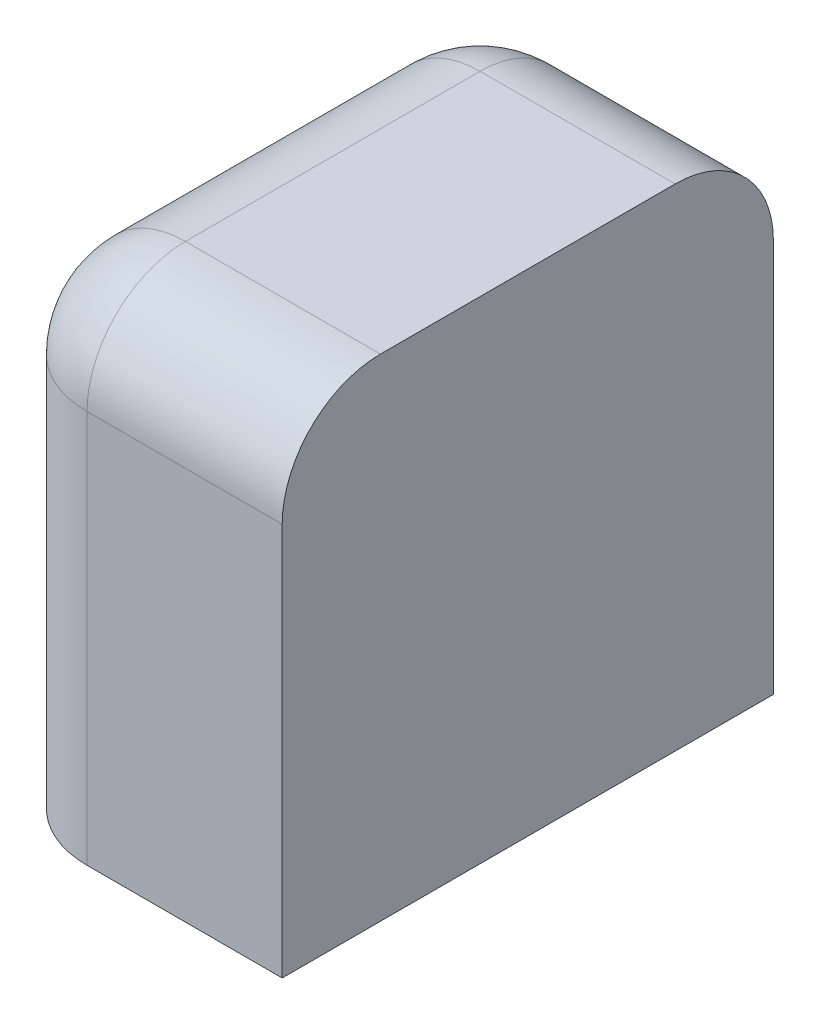
ISO-10303-21;
HEADER;
FILE_DESCRIPTION(('STEP AP214'),'2;1');
FILE_NAME('part.step','',(''),(''),'','','');
FILE_SCHEMA(('AUTOMOTIVE_DESIGN { 1 0 10303 214 1 1 1 1 }'));
ENDSEC;
DATA;
#1=APPLICATION_CONTEXT('core data for automotive mechanical design processes');
#2=APPLICATION_PROTOCOL_DEFINITION('international standard','automotive_design',2000,#1);
#3=PRODUCT_CONTEXT('',#1,'mechanical');
#4=PRODUCT('Part','Part','',(#3));
#5=PRODUCT_RELATED_PRODUCT_CATEGORY('part','',(#4));
#6=PRODUCT_DEFINITION_FORMATION('','',#4);
#7=PRODUCT_DEFINITION_CONTEXT('part definition',#1,'design');
#8=PRODUCT_DEFINITION('design','',#6,#7);
#9=PRODUCT_DEFINITION_SHAPE('','',#8);
#10=(LENGTH_UNIT() NAMED_UNIT(*) SI_UNIT(.MILLI.,.METRE.));
#11=(NAMED_UNIT(*) PLANE_ANGLE_UNIT() SI_UNIT($,.RADIAN.));
#12=(NAMED_UNIT(*) SI_UNIT($,.STERADIAN.) SOLID_ANGLE_UNIT());
#13=UNCERTAINTY_MEASURE_WITH_UNIT(LENGTH_MEASURE(1.E-05),#10,'distance_accuracy_value','');
#14=(GEOMETRIC_REPRESENTATION_CONTEXT(3) GLOBAL_UNCERTAINTY_ASSIGNED_CONTEXT((#13)) GLOBAL_UNIT_ASSIGNED_CONTEXT((#10,
#11,#12)) REPRESENTATION_CONTEXT('',''));
#15=CARTESIAN_POINT('',(0.,0.,0.));
#16=DIRECTION('',(0.,0.,1.));
#17=DIRECTION('',(1.,0.,0.));
#18=AXIS2_PLACEMENT_3D('',#15,#16,#17);
#19=CARTESIAN_POINT('',(1.8036,0.4,-0.15));
#20=DIRECTION('',(-1.,0.,0.));
#21=DIRECTION('',(0.,-0.707106781186547,0.707106781186548));
#22=AXIS2_PLACEMENT_3D('',#19,#20,#21);
#23=CYLINDRICAL_SURFACE('',#22,0.1);
#24=DIRECTION('',(-1.,0.,0.));
#25=VECTOR('',#24,1.);
#26=CARTESIAN_POINT('',(-0.2014,0.4,-0.25));
#27=LINE('',#26,#25);
#28=CARTESIAN_POINT('',(-0.2014,0.4,-0.25));
#29=VERTEX_POINT('',#28);
#30=CARTESIAN_POINT('',(-0.4,0.4,-0.25));
#31=VERTEX_POINT('',#30);
#32=EDGE_CURVE('E11',#29,#31,#27,.T.);
#33=ORIENTED_EDGE('',*,*,#32,.T.);
#34=CARTESIAN_POINT('',(-0.4,0.4,-0.15));
#35=DIRECTION('',(-1.,0.,0.));
#36=DIRECTION('',(0.,1.,0.));
#37=AXIS2_PLACEMENT_3D('',#34,#35,#36);
#38=CIRCLE('',#37,0.1);
#39=CARTESIAN_POINT('',(-0.4,0.5,-0.15));
#40=VERTEX_POINT('',#39);
#41=EDGE_CURVE('E25',#40,#31,#38,.T.);
#42=ORIENTED_EDGE('',*,*,#41,.F.);
#43=DIRECTION('',(-1.,0.,0.));
#44=VECTOR('',#43,1.);
#45=CARTESIAN_POINT('',(-0.2014,0.5,-0.15));
#46=LINE('',#45,#44);
#47=CARTESIAN_POINT('',(-0.2014,0.5,-0.15));
#48=VERTEX_POINT('',#47);
#49=EDGE_CURVE('E201',#48,#40,#46,.T.);
#50=ORIENTED_EDGE('',*,*,#49,.F.);
#51=CARTESIAN_POINT('',(-0.2014,0.4,-0.15));
#52=DIRECTION('',(1.,0.,0.));
#53=DIRECTION('',(0.,0.,-1.));
#54=AXIS2_PLACEMENT_3D('',#51,#52,#53);
#55=CIRCLE('',#54,0.1);
#56=EDGE_CURVE('E196',#29,#48,#55,.T.);
#57=ORIENTED_EDGE('',*,*,#56,.F.);
#58=EDGE_LOOP('',(#33,#42,#50,#57));
#59=FACE_BOUND('',#58,.T.);
#60=ADVANCED_FACE('F17',(#59),#23,.T.);
#61=CARTESIAN_POINT('',(-0.2014,0.,-0.25));
#62=DIRECTION('',(-1.,0.,0.));
#63=DIRECTION('',(0.,0.,1.));
#64=AXIS2_PLACEMENT_3D('',#61,#62,#63);
#65=PLANE('',#64);
#66=DIRECTION('',(0.,1.,0.));
#67=VECTOR('',#66,1.);
#68=CARTESIAN_POINT('',(-0.2014,0.,0.25));
#69=LINE('',#68,#67);
#70=CARTESIAN_POINT('',(-0.2014,0.,0.25));
#71=VERTEX_POINT('',#70);
#72=CARTESIAN_POINT('',(-0.2014,0.4,0.25));
#73=VERTEX_POINT('',#72);
#74=EDGE_CURVE('E191',#71,#73,#69,.T.);
#75=ORIENTED_EDGE('',*,*,#74,.F.);
#76=DIRECTION('',(0.,0.,-1.));
#77=VECTOR('',#76,1.);
#78=CARTESIAN_POINT('',(-0.2014,0.,0.25));
#79=LINE('',#78,#77);
#80=CARTESIAN_POINT('',(-0.2014,0.,-0.25));
#81=VERTEX_POINT('',#80);
#82=EDGE_CURVE('E187',#71,#81,#79,.T.);
#83=ORIENTED_EDGE('',*,*,#82,.T.);
#84=DIRECTION('',(0.,1.,0.));
#85=VECTOR('',#84,1.);
#86=CARTESIAN_POINT('',(-0.2014,0.,-0.25));
#87=LINE('',#86,#85);
#88=EDGE_CURVE('E182',#81,#29,#87,.T.);
#89=ORIENTED_EDGE('',*,*,#88,.T.);
#90=ORIENTED_EDGE('',*,*,#56,.T.);
#91=DIRECTION('',(0.,0.,-1.));
#92=VECTOR('',#91,1.);
#93=CARTESIAN_POINT('',(-0.2014,0.5,0.15));
#94=LINE('',#93,#92);
#95=CARTESIAN_POINT('',(-0.2014,0.5,0.15));
#96=VERTEX_POINT('',#95);
#97=EDGE_CURVE('E177',#96,#48,#94,.T.);
#98=ORIENTED_EDGE('',*,*,#97,.F.);
#99=CARTESIAN_POINT('',(-0.2014,0.4,0.15));
#100=DIRECTION('',(1.,0.,0.));
#101=DIRECTION('',(0.,1.,0.));
#102=AXIS2_PLACEMENT_3D('',#99,#100,#101);
#103=CIRCLE('',#102,0.1);
#104=EDGE_CURVE('E173',#96,#73,#103,.T.);
#105=ORIENTED_EDGE('',*,*,#104,.T.);
#106=EDGE_LOOP('',(#75,#83,#89,#90,#98,#105));
#107=FACE_BOUND('',#106,.T.);
#108=ADVANCED_FACE('F229',(#107),#65,.F.);
#109=CARTESIAN_POINT('',(-0.40189102071,0.4,0.15));
#110=DIRECTION('',(1.,0.,0.));
#111=DIRECTION('',(0.,-0.707106781186547,-0.707106781186548));
#112=AXIS2_PLACEMENT_3D('',#109,#110,#111);
#113=CYLINDRICAL_SURFACE('',#112,0.1);
#114=DIRECTION('',(1.,0.,0.));
#115=VECTOR('',#114,1.);
#116=CARTESIAN_POINT('',(-0.4,0.5,0.15));
#117=LINE('',#116,#115);
#118=CARTESIAN_POINT('',(-0.4,0.5,0.15));
#119=VERTEX_POINT('',#118);
#120=EDGE_CURVE('E168',#119,#96,#117,.T.);
#121=ORIENTED_EDGE('',*,*,#120,.F.);
#122=CARTESIAN_POINT('',(-0.4,0.4,0.15));
#123=DIRECTION('',(1.,0.,0.));
#124=DIRECTION('',(0.,1.,0.));
#125=AXIS2_PLACEMENT_3D('',#122,#123,#124);
#126=CIRCLE('',#125,0.1);
#127=CARTESIAN_POINT('',(-0.399999999999,0.4,0.25));
#128=VERTEX_POINT('',#127);
#129=EDGE_CURVE('E111',#119,#128,#126,.T.);
#130=ORIENTED_EDGE('',*,*,#129,.T.);
#131=DIRECTION('',(1.,0.,0.));
#132=VECTOR('',#131,1.);
#133=CARTESIAN_POINT('',(-0.399999999999,0.4,0.25));
#134=LINE('',#133,#132);
#135=EDGE_CURVE('E160',#128,#73,#134,.T.);
#136=ORIENTED_EDGE('',*,*,#135,.T.);
#137=ORIENTED_EDGE('',*,*,#104,.F.);
#138=EDGE_LOOP('',(#121,#130,#136,#137));
#139=FACE_BOUND('',#138,.T.);
#140=ADVANCED_FACE('F225',(#139),#113,.T.);
#141=CARTESIAN_POINT('',(-0.5,0.,0.25));
#142=DIRECTION('',(0.,0.,1.));
#143=DIRECTION('',(1.,0.,0.));
#144=AXIS2_PLACEMENT_3D('',#141,#142,#143);
#145=PLANE('',#144);
#146=DIRECTION('',(-1.623423617758E-12,-1.,0.));
#147=VECTOR('',#146,1.);
#148=CARTESIAN_POINT('',(-0.399999999999,0.4,0.25));
#149=LINE('',#148,#147);
#150=CARTESIAN_POINT('',(-0.4,0.,0.25));
#151=VERTEX_POINT('',#150);
#152=EDGE_CURVE('E105',#128,#151,#149,.T.);
#153=ORIENTED_EDGE('',*,*,#152,.T.);
#154=DIRECTION('',(1.,0.,0.));
#155=VECTOR('',#154,1.);
#156=CARTESIAN_POINT('',(-0.4,0.,0.25));
#157=LINE('',#156,#155);
#158=EDGE_CURVE('E152',#151,#71,#157,.T.);
#159=ORIENTED_EDGE('',*,*,#158,.T.);
#160=ORIENTED_EDGE('',*,*,#74,.T.);
#161=ORIENTED_EDGE('',*,*,#135,.F.);
#162=EDGE_LOOP('',(#153,#159,#160,#161));
#163=FACE_BOUND('',#162,.T.);
#164=ADVANCED_FACE('F222',(#163),#145,.T.);
#165=CARTESIAN_POINT('',(0.,0.,0.));
#166=DIRECTION('',(0.,1.,0.));
#167=DIRECTION('',(1.,0.,0.));
#168=AXIS2_PLACEMENT_3D('',#165,#166,#167);
#169=PLANE('',#168);
#170=DIRECTION('',(-1.,0.,0.));
#171=VECTOR('',#170,1.);
#172=CARTESIAN_POINT('',(-0.2014,0.,-0.25));
#173=LINE('',#172,#171);
#174=CARTESIAN_POINT('',(-0.4,0.,-0.25));
#175=VERTEX_POINT('',#174);
#176=EDGE_CURVE('E147',#81,#175,#173,.T.);
#177=ORIENTED_EDGE('',*,*,#176,.F.);
#178=ORIENTED_EDGE('',*,*,#82,.F.);
#179=ORIENTED_EDGE('',*,*,#158,.F.);
#180=CARTESIAN_POINT('',(-0.4,0.,0.15));
#181=DIRECTION('',(0.,-1.,0.));
#182=DIRECTION('',(0.,0.,1.));
#183=AXIS2_PLACEMENT_3D('',#180,#181,#182);
#184=CIRCLE('',#183,0.1);
#185=CARTESIAN_POINT('',(-0.5,0.,0.15));
#186=VERTEX_POINT('',#185);
#187=EDGE_CURVE('E143',#151,#186,#184,.T.);
#188=ORIENTED_EDGE('',*,*,#187,.T.);
#189=DIRECTION('',(0.,0.,1.));
#190=VECTOR('',#189,1.);
#191=CARTESIAN_POINT('',(-0.5,0.,-0.15));
#192=LINE('',#191,#190);
#193=CARTESIAN_POINT('',(-0.5,0.,-0.15));
#194=VERTEX_POINT('',#193);
#195=EDGE_CURVE('E97',#194,#186,#192,.T.);
#196=ORIENTED_EDGE('',*,*,#195,.F.);
#197=CARTESIAN_POINT('',(-0.4,0.,-0.15));
#198=DIRECTION('',(0.,-1.,0.));
#199=DIRECTION('',(-1.,0.,0.));
#200=AXIS2_PLACEMENT_3D('',#197,#198,#199);
#201=CIRCLE('',#200,0.1);
#202=EDGE_CURVE('E136',#194,#175,#201,.T.);
#203=ORIENTED_EDGE('',*,*,#202,.T.);
#204=EDGE_LOOP('',(#177,#178,#179,#188,#196,#203));
#205=FACE_BOUND('',#204,.T.);
#206=ADVANCED_FACE('F217',(#205),#169,.F.);
#207=CARTESIAN_POINT('',(-0.4,1.1518,-0.15));
#208=DIRECTION('',(0.,-1.,0.));
#209=DIRECTION('',(0.707106781179476,0.,0.707106781193619));
#210=AXIS2_PLACEMENT_3D('',#207,#208,#209);
#211=CYLINDRICAL_SURFACE('',#210,0.1);
#212=DIRECTION('',(-8.57133808374E-12,-1.,0.));
#213=VECTOR('',#212,1.);
#214=CARTESIAN_POINT('',(-0.399999999997,0.4,-0.25));
#215=LINE('',#214,#213);
#216=EDGE_CURVE('E131',#31,#175,#215,.T.);
#217=ORIENTED_EDGE('',*,*,#216,.T.);
#218=ORIENTED_EDGE('',*,*,#202,.F.);
#219=DIRECTION('',(0.,-1.,-1.623701173514E-12));
#220=VECTOR('',#219,1.);
#221=CARTESIAN_POINT('',(-0.5,0.4,-0.149999999999));
#222=LINE('',#221,#220);
#223=CARTESIAN_POINT('',(-0.5,0.4,-0.149999999999));
#224=VERTEX_POINT('',#223);
#225=EDGE_CURVE('E127',#224,#194,#222,.T.);
#226=ORIENTED_EDGE('',*,*,#225,.F.);
#227=CARTESIAN_POINT('',(-0.4,0.4,-0.15));
#228=DIRECTION('',(0.,1.,0.));
#229=DIRECTION('',(0.,0.,-1.));
#230=AXIS2_PLACEMENT_3D('',#227,#228,#229);
#231=CIRCLE('',#230,0.1);
#232=EDGE_CURVE('E123',#31,#224,#231,.T.);
#233=ORIENTED_EDGE('',*,*,#232,.F.);
#234=EDGE_LOOP('',(#217,#218,#226,#233));
#235=FACE_BOUND('',#234,.T.);
#236=ADVANCED_FACE('F213',(#235),#211,.T.);
#237=CARTESIAN_POINT('',(-0.4,0.4,-0.15));
#238=DIRECTION('',(0.707106781202048,0.,-0.707106781171048));
#239=DIRECTION('',(0.49999999998904,-0.707106781186548,0.50000000001096));
#240=AXIS2_PLACEMENT_3D('',#237,#238,#239);
#241=SPHERICAL_SURFACE('',#240,0.1);
#242=CARTESIAN_POINT('',(-0.4,0.4,-0.15));
#243=DIRECTION('',(0.,0.,1.));
#244=DIRECTION('',(0.,1.,0.));
#245=AXIS2_PLACEMENT_3D('',#242,#243,#244);
#246=CIRCLE('',#245,0.1);
#247=EDGE_CURVE('E87',#40,#224,#246,.T.);
#248=ORIENTED_EDGE('',*,*,#247,.F.);
#249=ORIENTED_EDGE('',*,*,#41,.T.);
#250=ORIENTED_EDGE('',*,*,#232,.T.);
#251=EDGE_LOOP('',(#248,#249,#250));
#252=FACE_BOUND('',#251,.T.);
#253=ADVANCED_FACE('F210',(#252),#241,.T.);
#254=CARTESIAN_POINT('',(-0.4,0.4,-0.15189102071));
#255=DIRECTION('',(0.,0.,1.));
#256=DIRECTION('',(0.707106781186548,-0.707106781186547,0.));
#257=AXIS2_PLACEMENT_3D('',#254,#255,#256);
#258=CYLINDRICAL_SURFACE('',#257,0.1);
#259=ORIENTED_EDGE('',*,*,#247,.T.);
#260=DIRECTION('',(0.,0.,1.));
#261=VECTOR('',#260,1.);
#262=CARTESIAN_POINT('',(-0.5,0.4,-0.149999999999));
#263=LINE('',#262,#261);
#264=CARTESIAN_POINT('',(-0.5,0.4,0.15));
#265=VERTEX_POINT('',#264);
#266=EDGE_CURVE('E79',#224,#265,#263,.T.);
#267=ORIENTED_EDGE('',*,*,#266,.T.);
#268=CARTESIAN_POINT('',(-0.4,0.4,0.15));
#269=DIRECTION('',(0.,0.,1.));
#270=DIRECTION('',(0.,1.,0.));
#271=AXIS2_PLACEMENT_3D('',#268,#269,#270);
#272=CIRCLE('',#271,0.1);
#273=EDGE_CURVE('E84',#119,#265,#272,.T.);
#274=ORIENTED_EDGE('',*,*,#273,.F.);
#275=DIRECTION('',(0.,0.,1.));
#276=VECTOR('',#275,1.);
#277=CARTESIAN_POINT('',(-0.4,0.5,-0.15));
#278=LINE('',#277,#276);
#279=EDGE_CURVE('E108',#40,#119,#278,.T.);
#280=ORIENTED_EDGE('',*,*,#279,.F.);
#281=EDGE_LOOP('',(#259,#267,#274,#280));
#282=FACE_BOUND('',#281,.T.);
#283=ADVANCED_FACE('F81',(#282),#258,.T.);
#284=CARTESIAN_POINT('',(0.,0.5,0.));
#285=DIRECTION('',(0.,1.,0.));
#286=DIRECTION('',(1.,0.,0.));
#287=AXIS2_PLACEMENT_3D('',#284,#285,#286);
#288=PLANE('',#287);
#289=ORIENTED_EDGE('',*,*,#97,.T.);
#290=ORIENTED_EDGE('',*,*,#49,.T.);
#291=ORIENTED_EDGE('',*,*,#279,.T.);
#292=ORIENTED_EDGE('',*,*,#120,.T.);
#293=EDGE_LOOP('',(#289,#290,#291,#292));
#294=FACE_BOUND('',#293,.T.);
#295=ADVANCED_FACE('F227',(#294),#288,.T.);
#296=CARTESIAN_POINT('',(-0.4,0.4,0.15));
#297=DIRECTION('',(-0.707106781171048,0.,-0.707106781202048));
#298=DIRECTION('',(0.50000000001096,-0.707106781186548,-0.49999999998904));
#299=AXIS2_PLACEMENT_3D('',#296,#297,#298);
#300=SPHERICAL_SURFACE('',#299,0.1);
#301=ORIENTED_EDGE('',*,*,#129,.F.);
#302=ORIENTED_EDGE('',*,*,#273,.T.);
#303=CARTESIAN_POINT('',(-0.4,0.4,0.15));
#304=DIRECTION('',(0.,1.,0.));
#305=DIRECTION('',(-1.,0.,0.));
#306=AXIS2_PLACEMENT_3D('',#303,#304,#305);
#307=CIRCLE('',#306,0.1);
#308=EDGE_CURVE('E100',#265,#128,#307,.T.);
#309=ORIENTED_EDGE('',*,*,#308,.T.);
#310=EDGE_LOOP('',(#301,#302,#309));
#311=FACE_BOUND('',#310,.T.);
#312=ADVANCED_FACE('F110',(#311),#300,.T.);
#313=CARTESIAN_POINT('',(-0.4,1.1518,0.15));
#314=DIRECTION('',(0.,-1.,0.));
#315=DIRECTION('',(0.707106781193619,0.,-0.707106781179476));
#316=AXIS2_PLACEMENT_3D('',#313,#314,#315);
#317=CYLINDRICAL_SURFACE('',#316,0.1);
#318=DIRECTION('',(0.,-1.,8.57133808374E-12));
#319=VECTOR('',#318,1.);
#320=CARTESIAN_POINT('',(-0.5,0.4,0.149999999997));
#321=LINE('',#320,#319);
#322=EDGE_CURVE('E94',#265,#186,#321,.T.);
#323=ORIENTED_EDGE('',*,*,#322,.T.);
#324=ORIENTED_EDGE('',*,*,#187,.F.);
#325=ORIENTED_EDGE('',*,*,#152,.F.);
#326=ORIENTED_EDGE('',*,*,#308,.F.);
#327=EDGE_LOOP('',(#323,#324,#325,#326));
#328=FACE_BOUND('',#327,.T.);
#329=ADVANCED_FACE('F104',(#328),#317,.T.);
#330=CARTESIAN_POINT('',(-0.5,0.,-0.25));
#331=DIRECTION('',(-1.,0.,0.));
#332=DIRECTION('',(0.,0.,1.));
#333=AXIS2_PLACEMENT_3D('',#330,#331,#332);
#334=PLANE('',#333);
#335=ORIENTED_EDGE('',*,*,#225,.T.);
#336=ORIENTED_EDGE('',*,*,#195,.T.);
#337=ORIENTED_EDGE('',*,*,#322,.F.);
#338=ORIENTED_EDGE('',*,*,#266,.F.);
#339=EDGE_LOOP('',(#335,#336,#337,#338));
#340=FACE_BOUND('',#339,.T.);
#341=ADVANCED_FACE('F96',(#340),#334,.T.);
#342=CARTESIAN_POINT('',(0.5,0.,-0.25));
#343=DIRECTION('',(0.,0.,-1.));
#344=DIRECTION('',(-1.,0.,0.));
#345=AXIS2_PLACEMENT_3D('',#342,#343,#344);
#346=PLANE('',#345);
#347=ORIENTED_EDGE('',*,*,#88,.F.);
#348=ORIENTED_EDGE('',*,*,#176,.T.);
#349=ORIENTED_EDGE('',*,*,#216,.F.);
#350=ORIENTED_EDGE('',*,*,#32,.F.);
#351=EDGE_LOOP('',(#347,#348,#349,#350));
#352=FACE_BOUND('',#351,.T.);
#353=ADVANCED_FACE('F231',(#352),#346,.T.);
#354=CLOSED_SHELL('',(#60,#108,#140,#164,#206,#236,#253,#283,#295,#312,#329,#341,#353));
#355=MANIFOLD_SOLID_BREP('B1',#354);
#356=ADVANCED_BREP_SHAPE_REPRESENTATION('',(#18,#355),#14);
#357=SHAPE_DEFINITION_REPRESENTATION(#9,#356);
ENDSEC;
END-ISO-10303-21;
